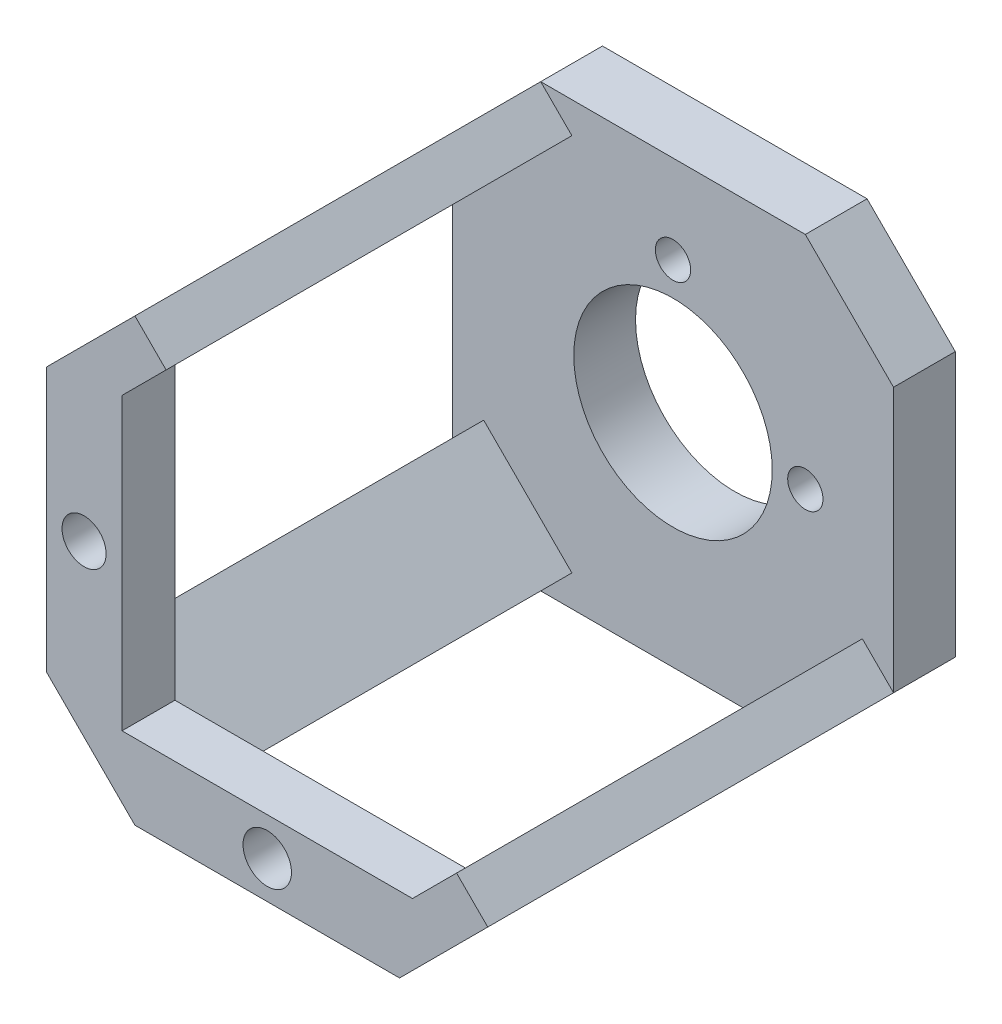
ISO-10303-21;
HEADER;
FILE_DESCRIPTION(('STEP AP214'),'2;1');
FILE_NAME('part.step','',(''),(''),'','','');
FILE_SCHEMA(('AUTOMOTIVE_DESIGN { 1 0 10303 214 1 1 1 1 }'));
ENDSEC;
DATA;
#1=APPLICATION_CONTEXT('core data for automotive mechanical design processes');
#2=APPLICATION_PROTOCOL_DEFINITION('international standard','automotive_design',2000,#1);
#3=PRODUCT_CONTEXT('',#1,'mechanical');
#4=PRODUCT('Part','Part','',(#3));
#5=PRODUCT_RELATED_PRODUCT_CATEGORY('part','',(#4));
#6=PRODUCT_DEFINITION_FORMATION('','',#4);
#7=PRODUCT_DEFINITION_CONTEXT('part definition',#1,'design');
#8=PRODUCT_DEFINITION('design','',#6,#7);
#9=PRODUCT_DEFINITION_SHAPE('','',#8);
#10=(LENGTH_UNIT() NAMED_UNIT(*) SI_UNIT(.MILLI.,.METRE.));
#11=(NAMED_UNIT(*) PLANE_ANGLE_UNIT() SI_UNIT($,.RADIAN.));
#12=(NAMED_UNIT(*) SI_UNIT($,.STERADIAN.) SOLID_ANGLE_UNIT());
#13=UNCERTAINTY_MEASURE_WITH_UNIT(LENGTH_MEASURE(1.E-05),#10,'distance_accuracy_value','');
#14=(GEOMETRIC_REPRESENTATION_CONTEXT(3) GLOBAL_UNCERTAINTY_ASSIGNED_CONTEXT((#13)) GLOBAL_UNIT_ASSIGNED_CONTEXT((#10,
#11,#12)) REPRESENTATION_CONTEXT('',''));
#15=CARTESIAN_POINT('',(0.,0.,0.));
#16=DIRECTION('',(0.,0.,1.));
#17=DIRECTION('',(1.,0.,0.));
#18=AXIS2_PLACEMENT_3D('',#15,#16,#17);
#19=CARTESIAN_POINT('',(0.,0.,7.));
#20=DIRECTION('',(0.,0.,1.));
#21=DIRECTION('',(1.,0.,0.));
#22=AXIS2_PLACEMENT_3D('',#19,#20,#21);
#23=PLANE('',#22);
#24=CARTESIAN_POINT('',(13.1164289128277,-2.01271186440679,7.));
#25=DIRECTION('',(0.,0.,1.));
#26=DIRECTION('',(1.,0.,0.));
#27=AXIS2_PLACEMENT_3D('',#24,#25,#26);
#28=CIRCLE('',#27,2.);
#29=CARTESIAN_POINT('',(15.1164289128277,-2.01271186440679,7.));
#30=VERTEX_POINT('',#29);
#31=EDGE_CURVE('E784',#30,#30,#28,.F.);
#32=ORIENTED_EDGE('',*,*,#31,.T.);
#33=EDGE_LOOP('',(#32));
#34=FACE_BOUND('',#33,.T.);
#35=CARTESIAN_POINT('',(-1.88357108717233,12.9872881355932,7.));
#36=DIRECTION('',(0.,0.,1.));
#37=DIRECTION('',(1.,0.,0.));
#38=AXIS2_PLACEMENT_3D('',#35,#36,#37);
#39=CIRCLE('',#38,2.);
#40=CARTESIAN_POINT('',(0.116428912827668,12.9872881355932,7.));
#41=VERTEX_POINT('',#40);
#42=EDGE_CURVE('E791',#41,#41,#39,.F.);
#43=ORIENTED_EDGE('',*,*,#42,.T.);
#44=EDGE_LOOP('',(#43));
#45=FACE_BOUND('',#44,.T.);
#46=CARTESIAN_POINT('',(-1.88357108717233,-2.01271186440679,7.));
#47=DIRECTION('',(0.,0.,1.));
#48=DIRECTION('',(1.,0.,0.));
#49=AXIS2_PLACEMENT_3D('',#46,#47,#48);
#50=CIRCLE('',#49,11.25);
#51=CARTESIAN_POINT('',(9.36642891282767,-2.01271186440679,7.));
#52=VERTEX_POINT('',#51);
#53=EDGE_CURVE('E225',#52,#52,#50,.F.);
#54=ORIENTED_EDGE('',*,*,#53,.T.);
#55=EDGE_LOOP('',(#54));
#56=FACE_BOUND('',#55,.T.);
#57=DIRECTION('',(-0.707106781186546,0.707106781186549,0.));
#58=VECTOR('',#57,1.);
#59=CARTESIAN_POINT('',(-13.3480371812396,-23.4771779584741,7.));
#60=LINE('',#59,#58);
#61=CARTESIAN_POINT('',(-13.3480371812396,-23.4771779584741,7.));
#62=VERTEX_POINT('',#61);
#63=CARTESIAN_POINT('',(-23.3480371812396,-13.477177958474,7.));
#64=VERTEX_POINT('',#63);
#65=EDGE_CURVE('E311',#62,#64,#60,.T.);
#66=ORIENTED_EDGE('',*,*,#65,.F.);
#67=DIRECTION('',(0.707106781186549,0.707106781186546,0.));
#68=VECTOR('',#67,1.);
#69=CARTESIAN_POINT('',(-16.8835710871723,-27.0127118644068,7.));
#70=LINE('',#69,#68);
#71=CARTESIAN_POINT('',(-16.8835710871723,-27.0127118644068,7.));
#72=VERTEX_POINT('',#71);
#73=EDGE_CURVE('E314',#72,#62,#70,.T.);
#74=ORIENTED_EDGE('',*,*,#73,.F.);
#75=DIRECTION('',(1.,0.,0.));
#76=VECTOR('',#75,1.);
#77=CARTESIAN_POINT('',(-26.8835710871723,-27.0127118644068,7.));
#78=LINE('',#77,#76);
#79=CARTESIAN_POINT('',(13.1164289128276,-27.0127118644068,7.));
#80=VERTEX_POINT('',#79);
#81=EDGE_CURVE('E366',#72,#80,#78,.T.);
#82=ORIENTED_EDGE('',*,*,#81,.T.);
#83=DIRECTION('',(0.707106781186555,-0.70710678118654,0.));
#84=VECTOR('',#83,1.);
#85=CARTESIAN_POINT('',(-6.94814147578972,-6.94814147578986,7.));
#86=LINE('',#85,#84);
#87=CARTESIAN_POINT('',(9.58089500689481,-23.4771779584741,7.));
#88=VERTEX_POINT('',#87);
#89=EDGE_CURVE('E337',#88,#80,#86,.T.);
#90=ORIENTED_EDGE('',*,*,#89,.F.);
#91=DIRECTION('',(-0.707106781186549,-0.707106781186546,0.));
#92=VECTOR('',#91,1.);
#93=CARTESIAN_POINT('',(16.5290364826844,-16.5290364826845,7.));
#94=LINE('',#93,#92);
#95=CARTESIAN_POINT('',(19.5808950068949,-13.477177958474,7.));
#96=VERTEX_POINT('',#95);
#97=EDGE_CURVE('E340',#96,#88,#94,.T.);
#98=ORIENTED_EDGE('',*,*,#97,.F.);
#99=DIRECTION('',(-0.707106781186551,0.707106781186544,0.));
#100=VECTOR('',#99,1.);
#101=CARTESIAN_POINT('',(3.05185852421033,3.05185852421036,7.));
#102=LINE('',#101,#100);
#103=CARTESIAN_POINT('',(23.1164289128277,-17.0127118644068,7.));
#104=VERTEX_POINT('',#103);
#105=EDGE_CURVE('E334',#104,#96,#102,.T.);
#106=ORIENTED_EDGE('',*,*,#105,.F.);
#107=DIRECTION('',(0.,-1.,0.));
#108=VECTOR('',#107,1.);
#109=CARTESIAN_POINT('',(23.1164289128277,22.9872881355932,7.));
#110=LINE('',#109,#108);
#111=CARTESIAN_POINT('',(23.1164289128277,12.9872881355932,7.));
#112=VERTEX_POINT('',#111);
#113=EDGE_CURVE('E370',#112,#104,#110,.T.);
#114=ORIENTED_EDGE('',*,*,#113,.F.);
#115=DIRECTION('',(0.707106781186546,-0.707106781186549,0.));
#116=VECTOR('',#115,1.);
#117=CARTESIAN_POINT('',(18.0518585242105,18.0518585242104,7.));
#118=LINE('',#117,#116);
#119=CARTESIAN_POINT('',(13.1164289128277,22.9872881355932,7.));
#120=VERTEX_POINT('',#119);
#121=EDGE_CURVE('E405',#112,#120,#118,.F.);
#122=ORIENTED_EDGE('',*,*,#121,.T.);
#123=DIRECTION('',(1.,0.,0.));
#124=VECTOR('',#123,1.);
#125=CARTESIAN_POINT('',(-26.8835710871723,22.9872881355932,7.));
#126=LINE('',#125,#124);
#127=CARTESIAN_POINT('',(-16.8835710871723,22.9872881355932,7.));
#128=VERTEX_POINT('',#127);
#129=EDGE_CURVE('E373',#128,#120,#126,.T.);
#130=ORIENTED_EDGE('',*,*,#129,.F.);
#131=DIRECTION('',(0.707106781186546,-0.707106781186549,0.));
#132=VECTOR('',#131,1.);
#133=CARTESIAN_POINT('',(3.05185852421043,3.05185852421042,7.));
#134=LINE('',#133,#132);
#135=CARTESIAN_POINT('',(-13.3480371812396,19.4517542296605,7.));
#136=VERTEX_POINT('',#135);
#137=EDGE_CURVE('E348',#128,#136,#134,.T.);
#138=ORIENTED_EDGE('',*,*,#137,.T.);
#139=DIRECTION('',(-0.707106781186548,-0.707106781186547,0.));
#140=VECTOR('',#139,1.);
#141=CARTESIAN_POINT('',(-16.39989570545,16.39989570545,7.));
#142=LINE('',#141,#140);
#143=CARTESIAN_POINT('',(-23.3480371812396,9.45175422966046,7.));
#144=VERTEX_POINT('',#143);
#145=EDGE_CURVE('E351',#136,#144,#142,.T.);
#146=ORIENTED_EDGE('',*,*,#145,.T.);
#147=DIRECTION('',(-0.707106781186547,0.707106781186548,0.));
#148=VECTOR('',#147,1.);
#149=CARTESIAN_POINT('',(-6.9481414757896,-6.94814147578958,7.));
#150=LINE('',#149,#148);
#151=CARTESIAN_POINT('',(-26.8835710871723,12.9872881355932,7.));
#152=VERTEX_POINT('',#151);
#153=EDGE_CURVE('E343',#144,#152,#150,.T.);
#154=ORIENTED_EDGE('',*,*,#153,.T.);
#155=DIRECTION('',(0.,-1.,0.));
#156=VECTOR('',#155,1.);
#157=CARTESIAN_POINT('',(-26.8835710871723,22.9872881355932,7.));
#158=LINE('',#157,#156);
#159=CARTESIAN_POINT('',(-26.8835710871723,-17.0127118644067,7.));
#160=VERTEX_POINT('',#159);
#161=EDGE_CURVE('E363',#152,#160,#158,.T.);
#162=ORIENTED_EDGE('',*,*,#161,.T.);
#163=DIRECTION('',(-0.707106781186549,-0.707106781186546,0.));
#164=VECTOR('',#163,1.);
#165=CARTESIAN_POINT('',(-23.3480371812396,-13.477177958474,7.));
#166=LINE('',#165,#164);
#167=EDGE_CURVE('E308',#64,#160,#166,.T.);
#168=ORIENTED_EDGE('',*,*,#167,.F.);
#169=EDGE_LOOP('',(#66,#74,#82,#90,#98,#106,#114,#122,#130,#138,#146,#154,#162,#168));
#170=FACE_BOUND('',#169,.T.);
#171=ADVANCED_FACE('F33',(#34,#45,#56,#170),#23,.T.);
#172=CARTESIAN_POINT('',(-26.8835710871723,22.9872881355932,7.));
#173=DIRECTION('',(1.,0.,0.));
#174=DIRECTION('',(0.,1.,0.));
#175=AXIS2_PLACEMENT_3D('',#172,#173,#174);
#176=PLANE('',#175);
#177=ORIENTED_EDGE('',*,*,#161,.F.);
#178=DIRECTION('',(0.,0.,-1.));
#179=VECTOR('',#178,1.);
#180=CARTESIAN_POINT('',(-26.8835710871723,12.9872881355932,0.));
#181=LINE('',#180,#179);
#182=CARTESIAN_POINT('',(-26.8835710871723,12.9872881355932,0.));
#183=VERTEX_POINT('',#182);
#184=EDGE_CURVE('E388',#152,#183,#181,.T.);
#185=ORIENTED_EDGE('',*,*,#184,.T.);
#186=DIRECTION('',(0.,-1.,0.));
#187=VECTOR('',#186,1.);
#188=CARTESIAN_POINT('',(-26.8835710871723,22.9872881355932,0.));
#189=LINE('',#188,#187);
#190=CARTESIAN_POINT('',(-26.8835710871723,-17.0127118644068,0.));
#191=VERTEX_POINT('',#190);
#192=EDGE_CURVE('E362',#183,#191,#189,.T.);
#193=ORIENTED_EDGE('',*,*,#192,.T.);
#194=DIRECTION('',(0.,0.,1.));
#195=VECTOR('',#194,1.);
#196=CARTESIAN_POINT('',(-26.8835710871723,-17.0127118644068,7.));
#197=LINE('',#196,#195);
#198=EDGE_CURVE('E376',#191,#160,#197,.T.);
#199=ORIENTED_EDGE('',*,*,#198,.T.);
#200=EDGE_LOOP('',(#177,#185,#193,#199));
#201=FACE_BOUND('',#200,.T.);
#202=ADVANCED_FACE('F457',(#201),#176,.F.);
#203=CARTESIAN_POINT('',(-26.8835710871723,-27.0127118644068,7.));
#204=DIRECTION('',(0.,1.,0.));
#205=DIRECTION('',(0.,0.,1.));
#206=AXIS2_PLACEMENT_3D('',#203,#204,#205);
#207=PLANE('',#206);
#208=ORIENTED_EDGE('',*,*,#81,.F.);
#209=DIRECTION('',(0.,0.,-1.));
#210=VECTOR('',#209,1.);
#211=CARTESIAN_POINT('',(-16.8835710871723,-27.0127118644068,7.));
#212=LINE('',#211,#210);
#213=CARTESIAN_POINT('',(-16.8835710871723,-27.0127118644068,0.));
#214=VERTEX_POINT('',#213);
#215=EDGE_CURVE('E11',#72,#214,#212,.T.);
#216=ORIENTED_EDGE('',*,*,#215,.T.);
#217=DIRECTION('',(1.,0.,0.));
#218=VECTOR('',#217,1.);
#219=CARTESIAN_POINT('',(-26.8835710871723,-27.0127118644068,0.));
#220=LINE('',#219,#218);
#221=CARTESIAN_POINT('',(13.1164289128276,-27.0127118644068,0.));
#222=VERTEX_POINT('',#221);
#223=EDGE_CURVE('E379',#214,#222,#220,.T.);
#224=ORIENTED_EDGE('',*,*,#223,.T.);
#225=DIRECTION('',(0.,0.,1.));
#226=VECTOR('',#225,1.);
#227=CARTESIAN_POINT('',(13.1164289128276,-27.0127118644068,7.));
#228=LINE('',#227,#226);
#229=EDGE_CURVE('E42',#222,#80,#228,.T.);
#230=ORIENTED_EDGE('',*,*,#229,.T.);
#231=EDGE_LOOP('',(#208,#216,#224,#230));
#232=FACE_BOUND('',#231,.T.);
#233=ADVANCED_FACE('F414',(#232),#207,.F.);
#234=CARTESIAN_POINT('',(23.1164289128277,22.9872881355932,7.));
#235=DIRECTION('',(1.,0.,0.));
#236=DIRECTION('',(0.,1.,0.));
#237=AXIS2_PLACEMENT_3D('',#234,#235,#236);
#238=PLANE('',#237);
#239=DIRECTION('',(0.,-1.,0.));
#240=VECTOR('',#239,1.);
#241=CARTESIAN_POINT('',(23.1164289128277,22.9872881355932,0.));
#242=LINE('',#241,#240);
#243=CARTESIAN_POINT('',(23.1164289128277,12.9872881355932,0.));
#244=VERTEX_POINT('',#243);
#245=CARTESIAN_POINT('',(23.1164289128277,-17.0127118644068,0.));
#246=VERTEX_POINT('',#245);
#247=EDGE_CURVE('E382',#244,#246,#242,.T.);
#248=ORIENTED_EDGE('',*,*,#247,.F.);
#249=DIRECTION('',(0.,0.,1.));
#250=VECTOR('',#249,1.);
#251=CARTESIAN_POINT('',(23.1164289128277,12.9872881355932,7.));
#252=LINE('',#251,#250);
#253=EDGE_CURVE('E410',#244,#112,#252,.T.);
#254=ORIENTED_EDGE('',*,*,#253,.T.);
#255=ORIENTED_EDGE('',*,*,#113,.T.);
#256=DIRECTION('',(0.,0.,-1.));
#257=VECTOR('',#256,1.);
#258=CARTESIAN_POINT('',(23.1164289128277,-17.0127118644068,0.));
#259=LINE('',#258,#257);
#260=EDGE_CURVE('E407',#104,#246,#259,.T.);
#261=ORIENTED_EDGE('',*,*,#260,.T.);
#262=EDGE_LOOP('',(#248,#254,#255,#261));
#263=FACE_BOUND('',#262,.T.);
#264=ADVANCED_FACE('F480',(#263),#238,.T.);
#265=CARTESIAN_POINT('',(-26.8835710871723,22.9872881355932,7.));
#266=DIRECTION('',(0.,1.,0.));
#267=DIRECTION('',(0.,0.,1.));
#268=AXIS2_PLACEMENT_3D('',#265,#266,#267);
#269=PLANE('',#268);
#270=DIRECTION('',(1.,0.,0.));
#271=VECTOR('',#270,1.);
#272=CARTESIAN_POINT('',(-26.8835710871723,22.9872881355932,0.));
#273=LINE('',#272,#271);
#274=CARTESIAN_POINT('',(-16.8835710871723,22.9872881355932,0.));
#275=VERTEX_POINT('',#274);
#276=CARTESIAN_POINT('',(13.1164289128277,22.9872881355932,0.));
#277=VERTEX_POINT('',#276);
#278=EDGE_CURVE('E367',#275,#277,#273,.T.);
#279=ORIENTED_EDGE('',*,*,#278,.F.);
#280=DIRECTION('',(0.,0.,1.));
#281=VECTOR('',#280,1.);
#282=CARTESIAN_POINT('',(-16.8835710871723,22.9872881355932,7.));
#283=LINE('',#282,#281);
#284=EDGE_CURVE('E402',#275,#128,#283,.T.);
#285=ORIENTED_EDGE('',*,*,#284,.T.);
#286=ORIENTED_EDGE('',*,*,#129,.T.);
#287=DIRECTION('',(0.,0.,-1.));
#288=VECTOR('',#287,1.);
#289=CARTESIAN_POINT('',(13.1164289128277,22.9872881355932,7.));
#290=LINE('',#289,#288);
#291=EDGE_CURVE('E399',#120,#277,#290,.T.);
#292=ORIENTED_EDGE('',*,*,#291,.T.);
#293=EDGE_LOOP('',(#279,#285,#286,#292));
#294=FACE_BOUND('',#293,.T.);
#295=ADVANCED_FACE('F476',(#294),#269,.T.);
#296=CARTESIAN_POINT('',(0.,0.,0.));
#297=DIRECTION('',(0.,0.,1.));
#298=DIRECTION('',(1.,0.,0.));
#299=AXIS2_PLACEMENT_3D('',#296,#297,#298);
#300=PLANE('',#299);
#301=CARTESIAN_POINT('',(13.1164289128277,-2.01271186440679,0.));
#302=DIRECTION('',(0.,0.,-1.));
#303=DIRECTION('',(-1.,0.,0.));
#304=AXIS2_PLACEMENT_3D('',#301,#302,#303);
#305=CIRCLE('',#304,2.);
#306=CARTESIAN_POINT('',(11.1164289128277,-2.01271186440679,0.));
#307=VERTEX_POINT('',#306);
#308=EDGE_CURVE('E782',#307,#307,#305,.T.);
#309=ORIENTED_EDGE('',*,*,#308,.F.);
#310=EDGE_LOOP('',(#309));
#311=FACE_BOUND('',#310,.T.);
#312=CARTESIAN_POINT('',(-1.88357108717233,12.9872881355932,0.));
#313=DIRECTION('',(0.,0.,-1.));
#314=DIRECTION('',(-1.,0.,0.));
#315=AXIS2_PLACEMENT_3D('',#312,#313,#314);
#316=CIRCLE('',#315,2.);
#317=CARTESIAN_POINT('',(-3.88357108717233,12.9872881355932,0.));
#318=VERTEX_POINT('',#317);
#319=EDGE_CURVE('E786',#318,#318,#316,.T.);
#320=ORIENTED_EDGE('',*,*,#319,.F.);
#321=EDGE_LOOP('',(#320));
#322=FACE_BOUND('',#321,.T.);
#323=CARTESIAN_POINT('',(-1.88357108717233,-2.01271186440679,0.));
#324=DIRECTION('',(0.,0.,-1.));
#325=DIRECTION('',(-1.,0.,0.));
#326=AXIS2_PLACEMENT_3D('',#323,#324,#325);
#327=CIRCLE('',#326,11.25);
#328=CARTESIAN_POINT('',(-13.1335710871723,-2.01271186440679,0.));
#329=VERTEX_POINT('',#328);
#330=EDGE_CURVE('E230',#329,#329,#327,.T.);
#331=ORIENTED_EDGE('',*,*,#330,.F.);
#332=EDGE_LOOP('',(#331));
#333=FACE_BOUND('',#332,.T.);
#334=ORIENTED_EDGE('',*,*,#192,.F.);
#335=DIRECTION('',(0.707106781186549,0.707106781186546,0.));
#336=VECTOR('',#335,1.);
#337=CARTESIAN_POINT('',(-26.8835710871723,12.9872881355932,0.));
#338=LINE('',#337,#336);
#339=EDGE_CURVE('E397',#183,#275,#338,.T.);
#340=ORIENTED_EDGE('',*,*,#339,.T.);
#341=ORIENTED_EDGE('',*,*,#278,.T.);
#342=DIRECTION('',(-0.707106781186546,0.707106781186549,0.));
#343=VECTOR('',#342,1.);
#344=CARTESIAN_POINT('',(13.1164289128277,22.9872881355932,0.));
#345=LINE('',#344,#343);
#346=EDGE_CURVE('E395',#277,#244,#345,.F.);
#347=ORIENTED_EDGE('',*,*,#346,.T.);
#348=ORIENTED_EDGE('',*,*,#247,.T.);
#349=DIRECTION('',(-0.707106781186549,-0.707106781186546,0.));
#350=VECTOR('',#349,1.);
#351=CARTESIAN_POINT('',(23.1164289128277,-17.0127118644068,0.));
#352=LINE('',#351,#350);
#353=EDGE_CURVE('E391',#246,#222,#352,.T.);
#354=ORIENTED_EDGE('',*,*,#353,.T.);
#355=ORIENTED_EDGE('',*,*,#223,.F.);
#356=DIRECTION('',(0.707106781186546,-0.707106781186549,0.));
#357=VECTOR('',#356,1.);
#358=CARTESIAN_POINT('',(-16.8835710871723,-27.0127118644068,0.));
#359=LINE('',#358,#357);
#360=EDGE_CURVE('E393',#214,#191,#359,.F.);
#361=ORIENTED_EDGE('',*,*,#360,.T.);
#362=EDGE_LOOP('',(#334,#340,#341,#347,#348,#354,#355,#361));
#363=FACE_BOUND('',#362,.T.);
#364=ADVANCED_FACE('F473',(#311,#322,#333,#363),#300,.F.);
#365=CARTESIAN_POINT('',(-26.8835710871723,12.9872881355932,7.));
#366=DIRECTION('',(-0.707106781186546,0.707106781186549,0.));
#367=DIRECTION('',(0.,0.,1.));
#368=AXIS2_PLACEMENT_3D('',#365,#366,#367);
#369=PLANE('',#368);
#370=ORIENTED_EDGE('',*,*,#184,.F.);
#371=DIRECTION('',(0.,0.,-1.));
#372=VECTOR('',#371,1.);
#373=CARTESIAN_POINT('',(-26.8835710871723,12.9872881355932,47.));
#374=LINE('',#373,#372);
#375=CARTESIAN_POINT('',(-26.8835710871723,12.9872881355932,47.));
#376=VERTEX_POINT('',#375);
#377=EDGE_CURVE('E347',#376,#152,#374,.T.);
#378=ORIENTED_EDGE('',*,*,#377,.F.);
#379=DIRECTION('',(0.,0.,-1.));
#380=VECTOR('',#379,1.);
#381=CARTESIAN_POINT('',(-26.8835710871723,12.9872881355932,53.));
#382=LINE('',#381,#380);
#383=CARTESIAN_POINT('',(-26.8835710871723,12.9872881355932,53.));
#384=VERTEX_POINT('',#383);
#385=EDGE_CURVE('E213',#384,#376,#382,.T.);
#386=ORIENTED_EDGE('',*,*,#385,.F.);
#387=DIRECTION('',(-0.707106781186549,-0.707106781186546,0.));
#388=VECTOR('',#387,1.);
#389=CARTESIAN_POINT('',(-16.8835710871723,22.9872881355932,53.));
#390=LINE('',#389,#388);
#391=CARTESIAN_POINT('',(-16.8835710871723,22.9872881355932,53.));
#392=VERTEX_POINT('',#391);
#393=EDGE_CURVE('E240',#392,#384,#390,.T.);
#394=ORIENTED_EDGE('',*,*,#393,.F.);
#395=DIRECTION('',(0.,0.,-1.));
#396=VECTOR('',#395,1.);
#397=CARTESIAN_POINT('',(-16.8835710871723,22.9872881355932,47.));
#398=LINE('',#397,#396);
#399=EDGE_CURVE('E357',#392,#128,#398,.T.);
#400=ORIENTED_EDGE('',*,*,#399,.T.);
#401=ORIENTED_EDGE('',*,*,#284,.F.);
#402=ORIENTED_EDGE('',*,*,#339,.F.);
#403=EDGE_LOOP('',(#370,#378,#386,#394,#400,#401,#402));
#404=FACE_BOUND('',#403,.T.);
#405=ADVANCED_FACE('F475',(#404),#369,.T.);
#406=CARTESIAN_POINT('',(13.1164289128277,22.9872881355932,7.));
#407=DIRECTION('',(-0.707106781186549,-0.707106781186546,0.));
#408=DIRECTION('',(0.,0.,-1.));
#409=AXIS2_PLACEMENT_3D('',#406,#407,#408);
#410=PLANE('',#409);
#411=ORIENTED_EDGE('',*,*,#121,.F.);
#412=ORIENTED_EDGE('',*,*,#253,.F.);
#413=ORIENTED_EDGE('',*,*,#346,.F.);
#414=ORIENTED_EDGE('',*,*,#291,.F.);
#415=EDGE_LOOP('',(#411,#412,#413,#414));
#416=FACE_BOUND('',#415,.T.);
#417=ADVANCED_FACE('F489',(#416),#410,.F.);
#418=CARTESIAN_POINT('',(-16.8835710871723,-27.0127118644068,7.));
#419=DIRECTION('',(0.707106781186549,0.707106781186546,0.));
#420=DIRECTION('',(0.,0.,-1.));
#421=AXIS2_PLACEMENT_3D('',#418,#419,#420);
#422=PLANE('',#421);
#423=ORIENTED_EDGE('',*,*,#215,.F.);
#424=DIRECTION('',(0.,0.,-1.));
#425=VECTOR('',#424,1.);
#426=CARTESIAN_POINT('',(-16.8835710871723,-27.0127118644068,47.));
#427=LINE('',#426,#425);
#428=CARTESIAN_POINT('',(-16.8835710871723,-27.0127118644068,47.));
#429=VERTEX_POINT('',#428);
#430=EDGE_CURVE('E304',#429,#72,#427,.T.);
#431=ORIENTED_EDGE('',*,*,#430,.F.);
#432=DIRECTION('',(0.,0.,-1.));
#433=VECTOR('',#432,1.);
#434=CARTESIAN_POINT('',(-16.8835710871723,-27.0127118644068,53.));
#435=LINE('',#434,#433);
#436=CARTESIAN_POINT('',(-16.8835710871723,-27.0127118644068,53.));
#437=VERTEX_POINT('',#436);
#438=EDGE_CURVE('E265',#437,#429,#435,.T.);
#439=ORIENTED_EDGE('',*,*,#438,.F.);
#440=DIRECTION('',(0.707106781186546,-0.707106781186549,0.));
#441=VECTOR('',#440,1.);
#442=CARTESIAN_POINT('',(-26.8835710871723,-17.0127118644067,53.));
#443=LINE('',#442,#441);
#444=CARTESIAN_POINT('',(-26.8835710871723,-17.0127118644067,53.));
#445=VERTEX_POINT('',#444);
#446=EDGE_CURVE('E244',#445,#437,#443,.T.);
#447=ORIENTED_EDGE('',*,*,#446,.F.);
#448=DIRECTION('',(0.,0.,-1.));
#449=VECTOR('',#448,1.);
#450=CARTESIAN_POINT('',(-26.8835710871723,-17.0127118644067,53.));
#451=LINE('',#450,#449);
#452=CARTESIAN_POINT('',(-26.8835710871723,-17.0127118644067,47.));
#453=VERTEX_POINT('',#452);
#454=EDGE_CURVE('E217',#445,#453,#451,.T.);
#455=ORIENTED_EDGE('',*,*,#454,.T.);
#456=DIRECTION('',(0.,0.,-1.));
#457=VECTOR('',#456,1.);
#458=CARTESIAN_POINT('',(-26.8835710871723,-17.0127118644067,47.));
#459=LINE('',#458,#457);
#460=EDGE_CURVE('E299',#453,#160,#459,.T.);
#461=ORIENTED_EDGE('',*,*,#460,.T.);
#462=ORIENTED_EDGE('',*,*,#198,.F.);
#463=ORIENTED_EDGE('',*,*,#360,.F.);
#464=EDGE_LOOP('',(#423,#431,#439,#447,#455,#461,#462,#463));
#465=FACE_BOUND('',#464,.T.);
#466=ADVANCED_FACE('F441',(#465),#422,.F.);
#467=CARTESIAN_POINT('',(23.1164289128277,-17.0127118644068,7.));
#468=DIRECTION('',(0.707106781186546,-0.707106781186549,0.));
#469=DIRECTION('',(0.,0.,1.));
#470=AXIS2_PLACEMENT_3D('',#467,#468,#469);
#471=PLANE('',#470);
#472=ORIENTED_EDGE('',*,*,#260,.F.);
#473=DIRECTION('',(0.,0.,-1.));
#474=VECTOR('',#473,1.);
#475=CARTESIAN_POINT('',(23.1164289128277,-17.0127118644068,47.));
#476=LINE('',#475,#474);
#477=CARTESIAN_POINT('',(23.1164289128277,-17.0127118644068,53.));
#478=VERTEX_POINT('',#477);
#479=EDGE_CURVE('E327',#478,#104,#476,.T.);
#480=ORIENTED_EDGE('',*,*,#479,.F.);
#481=DIRECTION('',(0.707106781186548,0.707106781186547,0.));
#482=VECTOR('',#481,1.);
#483=CARTESIAN_POINT('',(13.1164289128276,-27.0127118644068,53.));
#484=LINE('',#483,#482);
#485=CARTESIAN_POINT('',(13.1164289128276,-27.0127118644068,53.));
#486=VERTEX_POINT('',#485);
#487=EDGE_CURVE('E248',#486,#478,#484,.T.);
#488=ORIENTED_EDGE('',*,*,#487,.F.);
#489=DIRECTION('',(0.,0.,-1.));
#490=VECTOR('',#489,1.);
#491=CARTESIAN_POINT('',(13.1164289128276,-27.0127118644068,53.));
#492=LINE('',#491,#490);
#493=CARTESIAN_POINT('',(13.1164289128276,-27.0127118644068,47.));
#494=VERTEX_POINT('',#493);
#495=EDGE_CURVE('E262',#486,#494,#492,.T.);
#496=ORIENTED_EDGE('',*,*,#495,.T.);
#497=DIRECTION('',(0.,0.,-1.));
#498=VECTOR('',#497,1.);
#499=CARTESIAN_POINT('',(13.1164289128276,-27.0127118644068,47.));
#500=LINE('',#499,#498);
#501=EDGE_CURVE('E324',#494,#80,#500,.T.);
#502=ORIENTED_EDGE('',*,*,#501,.T.);
#503=ORIENTED_EDGE('',*,*,#229,.F.);
#504=ORIENTED_EDGE('',*,*,#353,.F.);
#505=EDGE_LOOP('',(#472,#480,#488,#496,#502,#503,#504));
#506=FACE_BOUND('',#505,.T.);
#507=ADVANCED_FACE('F35',(#506),#471,.T.);
#508=CARTESIAN_POINT('',(-6.9481414757896,-6.94814147578958,47.));
#509=DIRECTION('',(-0.707106781186548,-0.707106781186547,0.));
#510=DIRECTION('',(0.707106781186547,-0.707106781186548,0.));
#511=AXIS2_PLACEMENT_3D('',#508,#509,#510);
#512=PLANE('',#511);
#513=ORIENTED_EDGE('',*,*,#153,.F.);
#514=DIRECTION('',(0.,0.,-1.));
#515=VECTOR('',#514,1.);
#516=CARTESIAN_POINT('',(-23.3480371812396,9.45175422966046,47.));
#517=LINE('',#516,#515);
#518=CARTESIAN_POINT('',(-23.3480371812396,9.45175422966046,47.));
#519=VERTEX_POINT('',#518);
#520=EDGE_CURVE('E360',#519,#144,#517,.T.);
#521=ORIENTED_EDGE('',*,*,#520,.F.);
#522=DIRECTION('',(-0.707106781186547,0.707106781186548,0.));
#523=VECTOR('',#522,1.);
#524=CARTESIAN_POINT('',(-6.9481414757896,-6.94814147578958,47.));
#525=LINE('',#524,#523);
#526=EDGE_CURVE('E289',#519,#376,#525,.T.);
#527=ORIENTED_EDGE('',*,*,#526,.T.);
#528=ORIENTED_EDGE('',*,*,#377,.T.);
#529=EDGE_LOOP('',(#513,#521,#527,#528));
#530=FACE_BOUND('',#529,.T.);
#531=ADVANCED_FACE('F471',(#530),#512,.T.);
#532=CARTESIAN_POINT('',(-16.39989570545,16.39989570545,47.));
#533=DIRECTION('',(0.707106781186547,-0.707106781186548,0.));
#534=DIRECTION('',(0.707106781186548,0.707106781186547,0.));
#535=AXIS2_PLACEMENT_3D('',#532,#533,#534);
#536=PLANE('',#535);
#537=ORIENTED_EDGE('',*,*,#145,.F.);
#538=DIRECTION('',(0.,0.,-1.));
#539=VECTOR('',#538,1.);
#540=CARTESIAN_POINT('',(-13.3480371812396,19.4517542296605,47.));
#541=LINE('',#540,#539);
#542=CARTESIAN_POINT('',(-13.3480371812396,19.4517542296605,53.));
#543=VERTEX_POINT('',#542);
#544=EDGE_CURVE('E194',#543,#136,#541,.T.);
#545=ORIENTED_EDGE('',*,*,#544,.F.);
#546=DIRECTION('',(0.707106781186548,0.707106781186547,0.));
#547=VECTOR('',#546,1.);
#548=CARTESIAN_POINT('',(-18.3480371812396,14.4517542296605,53.));
#549=LINE('',#548,#547);
#550=CARTESIAN_POINT('',(-18.3480371812396,14.4517542296605,53.));
#551=VERTEX_POINT('',#550);
#552=EDGE_CURVE('E186',#551,#543,#549,.T.);
#553=ORIENTED_EDGE('',*,*,#552,.F.);
#554=DIRECTION('',(0.,0.,-1.));
#555=VECTOR('',#554,1.);
#556=CARTESIAN_POINT('',(-18.3480371812396,14.4517542296605,53.));
#557=LINE('',#556,#555);
#558=CARTESIAN_POINT('',(-18.3480371812396,14.4517542296605,47.));
#559=VERTEX_POINT('',#558);
#560=EDGE_CURVE('E192',#551,#559,#557,.T.);
#561=ORIENTED_EDGE('',*,*,#560,.T.);
#562=DIRECTION('',(-0.707106781186548,-0.707106781186547,0.));
#563=VECTOR('',#562,1.);
#564=CARTESIAN_POINT('',(-16.39989570545,16.39989570545,47.));
#565=LINE('',#564,#563);
#566=EDGE_CURVE('E215',#559,#519,#565,.T.);
#567=ORIENTED_EDGE('',*,*,#566,.T.);
#568=ORIENTED_EDGE('',*,*,#520,.T.);
#569=EDGE_LOOP('',(#537,#545,#553,#561,#567,#568));
#570=FACE_BOUND('',#569,.T.);
#571=ADVANCED_FACE('F189',(#570),#536,.T.);
#572=CARTESIAN_POINT('',(3.05185852421043,3.05185852421042,47.));
#573=DIRECTION('',(0.707106781186549,0.707106781186546,0.));
#574=DIRECTION('',(-0.707106781186546,0.707106781186549,0.));
#575=AXIS2_PLACEMENT_3D('',#572,#573,#574);
#576=PLANE('',#575);
#577=ORIENTED_EDGE('',*,*,#137,.F.);
#578=ORIENTED_EDGE('',*,*,#399,.F.);
#579=DIRECTION('',(-0.707106781186547,0.707106781186548,0.));
#580=VECTOR('',#579,1.);
#581=CARTESIAN_POINT('',(-13.3480371812396,19.4517542296605,53.));
#582=LINE('',#581,#580);
#583=EDGE_CURVE('E198',#543,#392,#582,.T.);
#584=ORIENTED_EDGE('',*,*,#583,.F.);
#585=ORIENTED_EDGE('',*,*,#544,.T.);
#586=EDGE_LOOP('',(#577,#578,#584,#585));
#587=FACE_BOUND('',#586,.T.);
#588=ADVANCED_FACE('F505',(#587),#576,.T.);
#589=CARTESIAN_POINT('',(16.5290364826844,-16.5290364826845,47.));
#590=DIRECTION('',(0.707106781186546,-0.707106781186549,0.));
#591=DIRECTION('',(0.707106781186549,0.707106781186546,0.));
#592=AXIS2_PLACEMENT_3D('',#589,#590,#591);
#593=PLANE('',#592);
#594=ORIENTED_EDGE('',*,*,#97,.T.);
#595=DIRECTION('',(0.,0.,-1.));
#596=VECTOR('',#595,1.);
#597=CARTESIAN_POINT('',(9.58089500689481,-23.4771779584741,47.));
#598=LINE('',#597,#596);
#599=CARTESIAN_POINT('',(9.58089500689481,-23.4771779584741,47.));
#600=VERTEX_POINT('',#599);
#601=EDGE_CURVE('E316',#600,#88,#598,.T.);
#602=ORIENTED_EDGE('',*,*,#601,.F.);
#603=DIRECTION('',(-0.707106781186549,-0.707106781186546,0.));
#604=VECTOR('',#603,1.);
#605=CARTESIAN_POINT('',(16.5290364826844,-16.5290364826845,47.));
#606=LINE('',#605,#604);
#607=CARTESIAN_POINT('',(14.5808950068949,-18.477177958474,47.));
#608=VERTEX_POINT('',#607);
#609=EDGE_CURVE('E50',#608,#600,#606,.T.);
#610=ORIENTED_EDGE('',*,*,#609,.F.);
#611=DIRECTION('',(0.,0.,-1.));
#612=VECTOR('',#611,1.);
#613=CARTESIAN_POINT('',(14.5808950068949,-18.477177958474,53.));
#614=LINE('',#613,#612);
#615=CARTESIAN_POINT('',(14.5808950068949,-18.477177958474,53.));
#616=VERTEX_POINT('',#615);
#617=EDGE_CURVE('E261',#616,#608,#614,.T.);
#618=ORIENTED_EDGE('',*,*,#617,.F.);
#619=DIRECTION('',(-0.707106781186549,-0.707106781186546,0.));
#620=VECTOR('',#619,1.);
#621=CARTESIAN_POINT('',(19.5808950068949,-13.477177958474,53.));
#622=LINE('',#621,#620);
#623=CARTESIAN_POINT('',(19.5808950068949,-13.477177958474,53.));
#624=VERTEX_POINT('',#623);
#625=EDGE_CURVE('E254',#624,#616,#622,.T.);
#626=ORIENTED_EDGE('',*,*,#625,.F.);
#627=DIRECTION('',(0.,0.,-1.));
#628=VECTOR('',#627,1.);
#629=CARTESIAN_POINT('',(19.5808950068949,-13.477177958474,47.));
#630=LINE('',#629,#628);
#631=EDGE_CURVE('E330',#624,#96,#630,.T.);
#632=ORIENTED_EDGE('',*,*,#631,.T.);
#633=EDGE_LOOP('',(#594,#602,#610,#618,#626,#632));
#634=FACE_BOUND('',#633,.T.);
#635=ADVANCED_FACE('F430',(#634),#593,.F.);
#636=CARTESIAN_POINT('',(-6.94814147578972,-6.94814147578986,47.));
#637=DIRECTION('',(0.70710678118654,0.707106781186555,0.));
#638=DIRECTION('',(-0.707106781186555,0.70710678118654,0.));
#639=AXIS2_PLACEMENT_3D('',#636,#637,#638);
#640=PLANE('',#639);
#641=ORIENTED_EDGE('',*,*,#89,.T.);
#642=ORIENTED_EDGE('',*,*,#501,.F.);
#643=DIRECTION('',(0.707106781186555,-0.70710678118654,0.));
#644=VECTOR('',#643,1.);
#645=CARTESIAN_POINT('',(-6.94814147578972,-6.94814147578986,47.));
#646=LINE('',#645,#644);
#647=EDGE_CURVE('E333',#600,#494,#646,.T.);
#648=ORIENTED_EDGE('',*,*,#647,.F.);
#649=ORIENTED_EDGE('',*,*,#601,.T.);
#650=EDGE_LOOP('',(#641,#642,#648,#649));
#651=FACE_BOUND('',#650,.T.);
#652=ADVANCED_FACE('F420',(#651),#640,.F.);
#653=CARTESIAN_POINT('',(3.05185852421033,3.05185852421036,47.));
#654=DIRECTION('',(-0.707106781186544,-0.707106781186551,0.));
#655=DIRECTION('',(0.707106781186551,-0.707106781186544,0.));
#656=AXIS2_PLACEMENT_3D('',#653,#654,#655);
#657=PLANE('',#656);
#658=ORIENTED_EDGE('',*,*,#105,.T.);
#659=ORIENTED_EDGE('',*,*,#631,.F.);
#660=DIRECTION('',(-0.70710678118655,0.707106781186545,0.));
#661=VECTOR('',#660,1.);
#662=CARTESIAN_POINT('',(23.1164289128277,-17.0127118644068,53.));
#663=LINE('',#662,#661);
#664=EDGE_CURVE('E251',#478,#624,#663,.T.);
#665=ORIENTED_EDGE('',*,*,#664,.F.);
#666=ORIENTED_EDGE('',*,*,#479,.T.);
#667=EDGE_LOOP('',(#658,#659,#665,#666));
#668=FACE_BOUND('',#667,.T.);
#669=ADVANCED_FACE('F435',(#668),#657,.F.);
#670=CARTESIAN_POINT('',(-16.8835710871723,-27.0127118644068,47.));
#671=DIRECTION('',(-0.707106781186546,0.707106781186549,0.));
#672=DIRECTION('',(-0.707106781186549,-0.707106781186546,0.));
#673=AXIS2_PLACEMENT_3D('',#670,#671,#672);
#674=PLANE('',#673);
#675=ORIENTED_EDGE('',*,*,#73,.T.);
#676=DIRECTION('',(0.,0.,-1.));
#677=VECTOR('',#676,1.);
#678=CARTESIAN_POINT('',(-13.3480371812396,-23.4771779584741,47.));
#679=LINE('',#678,#677);
#680=CARTESIAN_POINT('',(-13.3480371812396,-23.4771779584741,47.));
#681=VERTEX_POINT('',#680);
#682=EDGE_CURVE('E292',#681,#62,#679,.T.);
#683=ORIENTED_EDGE('',*,*,#682,.F.);
#684=DIRECTION('',(0.707106781186549,0.707106781186546,0.));
#685=VECTOR('',#684,1.);
#686=CARTESIAN_POINT('',(-16.8835710871723,-27.0127118644068,47.));
#687=LINE('',#686,#685);
#688=EDGE_CURVE('E312',#429,#681,#687,.T.);
#689=ORIENTED_EDGE('',*,*,#688,.F.);
#690=ORIENTED_EDGE('',*,*,#430,.T.);
#691=EDGE_LOOP('',(#675,#683,#689,#690));
#692=FACE_BOUND('',#691,.T.);
#693=ADVANCED_FACE('F443',(#692),#674,.F.);
#694=CARTESIAN_POINT('',(-13.3480371812396,-23.4771779584741,47.));
#695=DIRECTION('',(-0.707106781186549,-0.707106781186546,0.));
#696=DIRECTION('',(0.707106781186546,-0.707106781186549,0.));
#697=AXIS2_PLACEMENT_3D('',#694,#695,#696);
#698=PLANE('',#697);
#699=ORIENTED_EDGE('',*,*,#65,.T.);
#700=DIRECTION('',(0.,0.,-1.));
#701=VECTOR('',#700,1.);
#702=CARTESIAN_POINT('',(-23.3480371812396,-13.477177958474,47.));
#703=LINE('',#702,#701);
#704=CARTESIAN_POINT('',(-23.3480371812396,-13.477177958474,47.));
#705=VERTEX_POINT('',#704);
#706=EDGE_CURVE('E294',#705,#64,#703,.T.);
#707=ORIENTED_EDGE('',*,*,#706,.F.);
#708=DIRECTION('',(-0.707106781186546,0.707106781186549,0.));
#709=VECTOR('',#708,1.);
#710=CARTESIAN_POINT('',(-13.3480371812396,-23.4771779584741,47.));
#711=LINE('',#710,#709);
#712=CARTESIAN_POINT('',(-18.3480371812396,-18.477177958474,47.));
#713=VERTEX_POINT('',#712);
#714=EDGE_CURVE('E58',#713,#705,#711,.T.);
#715=ORIENTED_EDGE('',*,*,#714,.F.);
#716=EDGE_CURVE('E318',#681,#713,#711,.T.);
#717=ORIENTED_EDGE('',*,*,#716,.F.);
#718=ORIENTED_EDGE('',*,*,#682,.T.);
#719=EDGE_LOOP('',(#699,#707,#715,#717,#718));
#720=FACE_BOUND('',#719,.T.);
#721=ADVANCED_FACE('F445',(#720),#698,.F.);
#722=CARTESIAN_POINT('',(-23.3480371812396,-13.477177958474,47.));
#723=DIRECTION('',(0.707106781186546,-0.707106781186549,0.));
#724=DIRECTION('',(0.707106781186549,0.707106781186546,0.));
#725=AXIS2_PLACEMENT_3D('',#722,#723,#724);
#726=PLANE('',#725);
#727=ORIENTED_EDGE('',*,*,#167,.T.);
#728=ORIENTED_EDGE('',*,*,#460,.F.);
#729=DIRECTION('',(-0.707106781186549,-0.707106781186546,0.));
#730=VECTOR('',#729,1.);
#731=CARTESIAN_POINT('',(-23.3480371812396,-13.477177958474,47.));
#732=LINE('',#731,#730);
#733=EDGE_CURVE('E307',#705,#453,#732,.T.);
#734=ORIENTED_EDGE('',*,*,#733,.F.);
#735=ORIENTED_EDGE('',*,*,#706,.T.);
#736=EDGE_LOOP('',(#727,#728,#734,#735));
#737=FACE_BOUND('',#736,.T.);
#738=ADVANCED_FACE('F451',(#737),#726,.F.);
#739=CARTESIAN_POINT('',(0.,0.,47.));
#740=DIRECTION('',(0.,0.,-1.));
#741=DIRECTION('',(-1.,0.,0.));
#742=AXIS2_PLACEMENT_3D('',#739,#740,#741);
#743=PLANE('',#742);
#744=CARTESIAN_POINT('',(-22.6480371812396,-2.01271186440679,47.));
#745=DIRECTION('',(0.,0.,-1.));
#746=DIRECTION('',(-1.,0.,0.));
#747=AXIS2_PLACEMENT_3D('',#744,#745,#746);
#748=CIRCLE('',#747,2.5);
#749=CARTESIAN_POINT('',(-25.1480371812396,-2.01271186440679,47.));
#750=VERTEX_POINT('',#749);
#751=EDGE_CURVE('E235',#750,#750,#748,.F.);
#752=ORIENTED_EDGE('',*,*,#751,.T.);
#753=EDGE_LOOP('',(#752));
#754=FACE_BOUND('',#753,.T.);
#755=ORIENTED_EDGE('',*,*,#526,.F.);
#756=ORIENTED_EDGE('',*,*,#566,.F.);
#757=DIRECTION('',(0.,1.,0.));
#758=VECTOR('',#757,1.);
#759=CARTESIAN_POINT('',(-18.3480371812396,-18.477177958474,47.));
#760=LINE('',#759,#758);
#761=EDGE_CURVE('E212',#713,#559,#760,.T.);
#762=ORIENTED_EDGE('',*,*,#761,.F.);
#763=ORIENTED_EDGE('',*,*,#714,.T.);
#764=ORIENTED_EDGE('',*,*,#733,.T.);
#765=DIRECTION('',(0.,-1.,0.));
#766=VECTOR('',#765,1.);
#767=CARTESIAN_POINT('',(-26.8835710871723,12.9872881355932,47.));
#768=LINE('',#767,#766);
#769=EDGE_CURVE('E224',#376,#453,#768,.T.);
#770=ORIENTED_EDGE('',*,*,#769,.F.);
#771=EDGE_LOOP('',(#755,#756,#762,#763,#764,#770));
#772=FACE_BOUND('',#771,.T.);
#773=ADVANCED_FACE('F285',(#754,#772),#743,.T.);
#774=CARTESIAN_POINT('',(-1.88357108717233,-22.777177958474,47.));
#775=DIRECTION('',(0.,0.,-1.));
#776=DIRECTION('',(-1.,0.,0.));
#777=AXIS2_PLACEMENT_3D('',#774,#775,#776);
#778=CIRCLE('',#777,2.74500766384704);
#779=CARTESIAN_POINT('',(-4.62857875101938,-22.777177958474,47.));
#780=VERTEX_POINT('',#779);
#781=EDGE_CURVE('E797',#780,#780,#778,.F.);
#782=ORIENTED_EDGE('',*,*,#781,.T.);
#783=EDGE_LOOP('',(#782));
#784=FACE_BOUND('',#783,.T.);
#785=DIRECTION('',(-1.,0.,0.));
#786=VECTOR('',#785,1.);
#787=CARTESIAN_POINT('',(14.5808950068949,-18.477177958474,47.));
#788=LINE('',#787,#786);
#789=EDGE_CURVE('E208',#608,#713,#788,.T.);
#790=ORIENTED_EDGE('',*,*,#789,.F.);
#791=ORIENTED_EDGE('',*,*,#609,.T.);
#792=ORIENTED_EDGE('',*,*,#647,.T.);
#793=DIRECTION('',(1.,0.,0.));
#794=VECTOR('',#793,1.);
#795=CARTESIAN_POINT('',(-16.8835710871723,-27.0127118644068,47.));
#796=LINE('',#795,#794);
#797=EDGE_CURVE('E227',#429,#494,#796,.T.);
#798=ORIENTED_EDGE('',*,*,#797,.F.);
#799=ORIENTED_EDGE('',*,*,#688,.T.);
#800=ORIENTED_EDGE('',*,*,#716,.T.);
#801=EDGE_LOOP('',(#790,#791,#792,#798,#799,#800));
#802=FACE_BOUND('',#801,.T.);
#803=ADVANCED_FACE('F428',(#784,#802),#743,.T.);
#804=CARTESIAN_POINT('',(-18.3480371812396,-18.477177958474,53.));
#805=DIRECTION('',(-1.,0.,0.));
#806=DIRECTION('',(0.,-1.,0.));
#807=AXIS2_PLACEMENT_3D('',#804,#805,#806);
#808=PLANE('',#807);
#809=ORIENTED_EDGE('',*,*,#761,.T.);
#810=ORIENTED_EDGE('',*,*,#560,.F.);
#811=DIRECTION('',(0.,1.,0.));
#812=VECTOR('',#811,1.);
#813=CARTESIAN_POINT('',(-18.3480371812396,-18.477177958474,53.));
#814=LINE('',#813,#812);
#815=CARTESIAN_POINT('',(-18.3480371812396,-18.477177958474,53.));
#816=VERTEX_POINT('',#815);
#817=EDGE_CURVE('E199',#816,#551,#814,.T.);
#818=ORIENTED_EDGE('',*,*,#817,.F.);
#819=DIRECTION('',(0.,0.,-1.));
#820=VECTOR('',#819,1.);
#821=CARTESIAN_POINT('',(-18.3480371812396,-18.477177958474,53.));
#822=LINE('',#821,#820);
#823=EDGE_CURVE('E256',#816,#713,#822,.T.);
#824=ORIENTED_EDGE('',*,*,#823,.T.);
#825=EDGE_LOOP('',(#809,#810,#818,#824));
#826=FACE_BOUND('',#825,.T.);
#827=ADVANCED_FACE('F210',(#826),#808,.F.);
#828=CARTESIAN_POINT('',(-26.8835710871723,12.9872881355932,53.));
#829=DIRECTION('',(1.,0.,0.));
#830=DIRECTION('',(0.,1.,0.));
#831=AXIS2_PLACEMENT_3D('',#828,#829,#830);
#832=PLANE('',#831);
#833=ORIENTED_EDGE('',*,*,#769,.T.);
#834=ORIENTED_EDGE('',*,*,#454,.F.);
#835=DIRECTION('',(0.,-1.,0.));
#836=VECTOR('',#835,1.);
#837=CARTESIAN_POINT('',(-26.8835710871723,12.9872881355932,53.));
#838=LINE('',#837,#836);
#839=EDGE_CURVE('E242',#384,#445,#838,.T.);
#840=ORIENTED_EDGE('',*,*,#839,.F.);
#841=ORIENTED_EDGE('',*,*,#385,.T.);
#842=EDGE_LOOP('',(#833,#834,#840,#841));
#843=FACE_BOUND('',#842,.T.);
#844=ADVANCED_FACE('F518',(#843),#832,.F.);
#845=CARTESIAN_POINT('',(-16.8835710871723,-27.0127118644068,53.));
#846=DIRECTION('',(0.,1.,0.));
#847=DIRECTION('',(-1.,0.,0.));
#848=AXIS2_PLACEMENT_3D('',#845,#846,#847);
#849=PLANE('',#848);
#850=ORIENTED_EDGE('',*,*,#797,.T.);
#851=ORIENTED_EDGE('',*,*,#495,.F.);
#852=DIRECTION('',(1.,0.,0.));
#853=VECTOR('',#852,1.);
#854=CARTESIAN_POINT('',(-16.8835710871723,-27.0127118644068,53.));
#855=LINE('',#854,#853);
#856=EDGE_CURVE('E246',#437,#486,#855,.T.);
#857=ORIENTED_EDGE('',*,*,#856,.F.);
#858=ORIENTED_EDGE('',*,*,#438,.T.);
#859=EDGE_LOOP('',(#850,#851,#857,#858));
#860=FACE_BOUND('',#859,.T.);
#861=ADVANCED_FACE('F425',(#860),#849,.F.);
#862=CARTESIAN_POINT('',(14.5808950068949,-18.477177958474,53.));
#863=DIRECTION('',(0.,-1.,0.));
#864=DIRECTION('',(1.,0.,0.));
#865=AXIS2_PLACEMENT_3D('',#862,#863,#864);
#866=PLANE('',#865);
#867=ORIENTED_EDGE('',*,*,#789,.T.);
#868=ORIENTED_EDGE('',*,*,#823,.F.);
#869=DIRECTION('',(-1.,0.,0.));
#870=VECTOR('',#869,1.);
#871=CARTESIAN_POINT('',(14.5808950068949,-18.477177958474,53.));
#872=LINE('',#871,#870);
#873=EDGE_CURVE('E204',#616,#816,#872,.T.);
#874=ORIENTED_EDGE('',*,*,#873,.F.);
#875=ORIENTED_EDGE('',*,*,#617,.T.);
#876=EDGE_LOOP('',(#867,#868,#874,#875));
#877=FACE_BOUND('',#876,.T.);
#878=ADVANCED_FACE('F282',(#877),#866,.F.);
#879=CARTESIAN_POINT('',(0.,0.,53.));
#880=DIRECTION('',(0.,0.,-1.));
#881=DIRECTION('',(-1.,0.,0.));
#882=AXIS2_PLACEMENT_3D('',#879,#880,#881);
#883=PLANE('',#882);
#884=CARTESIAN_POINT('',(-1.88357108717233,-22.777177958474,53.));
#885=DIRECTION('',(0.,0.,1.));
#886=DIRECTION('',(1.,0.,0.));
#887=AXIS2_PLACEMENT_3D('',#884,#885,#886);
#888=CIRCLE('',#887,2.74500766384704);
#889=CARTESIAN_POINT('',(0.861436576674712,-22.777177958474,53.));
#890=VERTEX_POINT('',#889);
#891=EDGE_CURVE('E794',#890,#890,#888,.T.);
#892=ORIENTED_EDGE('',*,*,#891,.F.);
#893=EDGE_LOOP('',(#892));
#894=FACE_BOUND('',#893,.T.);
#895=CARTESIAN_POINT('',(-22.6480371812396,-2.01271186440679,53.));
#896=DIRECTION('',(0.,0.,1.));
#897=DIRECTION('',(1.,0.,0.));
#898=AXIS2_PLACEMENT_3D('',#895,#896,#897);
#899=CIRCLE('',#898,2.5);
#900=CARTESIAN_POINT('',(-20.1480371812396,-2.01271186440679,53.));
#901=VERTEX_POINT('',#900);
#902=EDGE_CURVE('E800',#901,#901,#899,.T.);
#903=ORIENTED_EDGE('',*,*,#902,.F.);
#904=EDGE_LOOP('',(#903));
#905=FACE_BOUND('',#904,.T.);
#906=ORIENTED_EDGE('',*,*,#817,.T.);
#907=ORIENTED_EDGE('',*,*,#552,.T.);
#908=ORIENTED_EDGE('',*,*,#583,.T.);
#909=ORIENTED_EDGE('',*,*,#393,.T.);
#910=ORIENTED_EDGE('',*,*,#839,.T.);
#911=ORIENTED_EDGE('',*,*,#446,.T.);
#912=ORIENTED_EDGE('',*,*,#856,.T.);
#913=ORIENTED_EDGE('',*,*,#487,.T.);
#914=ORIENTED_EDGE('',*,*,#664,.T.);
#915=ORIENTED_EDGE('',*,*,#625,.T.);
#916=ORIENTED_EDGE('',*,*,#873,.T.);
#917=EDGE_LOOP('',(#906,#907,#908,#909,#910,#911,#912,#913,#914,#915,#916));
#918=FACE_BOUND('',#917,.T.);
#919=ADVANCED_FACE('F202',(#894,#905,#918),#883,.F.);
#920=CARTESIAN_POINT('',(-1.88357108717233,-2.01271186440679,38.8198051533946));
#921=DIRECTION('',(0.,0.,-1.));
#922=DIRECTION('',(-1.,0.,0.));
#923=AXIS2_PLACEMENT_3D('',#920,#921,#922);
#924=CYLINDRICAL_SURFACE('',#923,11.25);
#925=ORIENTED_EDGE('',*,*,#330,.T.);
#926=EDGE_LOOP('',(#925));
#927=FACE_BOUND('',#926,.T.);
#928=ORIENTED_EDGE('',*,*,#53,.F.);
#929=EDGE_LOOP('',(#928));
#930=FACE_BOUND('',#929,.T.);
#931=ADVANCED_FACE('F590',(#927,#930),#924,.F.);
#932=CARTESIAN_POINT('',(-22.6480371812396,-2.01271186440679,39.2359458659389));
#933=DIRECTION('',(0.,0.,1.));
#934=DIRECTION('',(1.,0.,0.));
#935=AXIS2_PLACEMENT_3D('',#932,#933,#934);
#936=CYLINDRICAL_SURFACE('',#935,2.5);
#937=ORIENTED_EDGE('',*,*,#902,.T.);
#938=EDGE_LOOP('',(#937));
#939=FACE_BOUND('',#938,.T.);
#940=ORIENTED_EDGE('',*,*,#751,.F.);
#941=EDGE_LOOP('',(#940));
#942=FACE_BOUND('',#941,.T.);
#943=ADVANCED_FACE('F598',(#939,#942),#936,.F.);
#944=CARTESIAN_POINT('',(-1.88357108717233,-22.777177958474,39.2359458659389));
#945=DIRECTION('',(0.,0.,1.));
#946=DIRECTION('',(1.,0.,0.));
#947=AXIS2_PLACEMENT_3D('',#944,#945,#946);
#948=CYLINDRICAL_SURFACE('',#947,2.74500766384704);
#949=ORIENTED_EDGE('',*,*,#891,.T.);
#950=EDGE_LOOP('',(#949));
#951=FACE_BOUND('',#950,.T.);
#952=ORIENTED_EDGE('',*,*,#781,.F.);
#953=EDGE_LOOP('',(#952));
#954=FACE_BOUND('',#953,.T.);
#955=ADVANCED_FACE('F605',(#951,#954),#948,.F.);
#956=CARTESIAN_POINT('',(-1.88357108717233,12.9872881355932,12.6568542494924));
#957=DIRECTION('',(0.,0.,-1.));
#958=DIRECTION('',(-1.,0.,0.));
#959=AXIS2_PLACEMENT_3D('',#956,#957,#958);
#960=CYLINDRICAL_SURFACE('',#959,2.);
#961=ORIENTED_EDGE('',*,*,#319,.T.);
#962=EDGE_LOOP('',(#961));
#963=FACE_BOUND('',#962,.T.);
#964=ORIENTED_EDGE('',*,*,#42,.F.);
#965=EDGE_LOOP('',(#964));
#966=FACE_BOUND('',#965,.T.);
#967=ADVANCED_FACE('F612',(#963,#966),#960,.F.);
#968=CARTESIAN_POINT('',(13.1164289128277,-2.01271186440679,12.6568542494924));
#969=DIRECTION('',(0.,0.,-1.));
#970=DIRECTION('',(-1.,0.,0.));
#971=AXIS2_PLACEMENT_3D('',#968,#969,#970);
#972=CYLINDRICAL_SURFACE('',#971,2.);
#973=ORIENTED_EDGE('',*,*,#308,.T.);
#974=EDGE_LOOP('',(#973));
#975=FACE_BOUND('',#974,.T.);
#976=ORIENTED_EDGE('',*,*,#31,.F.);
#977=EDGE_LOOP('',(#976));
#978=FACE_BOUND('',#977,.T.);
#979=ADVANCED_FACE('F620',(#975,#978),#972,.F.);
#980=CLOSED_SHELL('',(#171,#202,#233,#264,#295,#364,#405,#417,#466,#507,#531,#571,#588,#635,
#652,#669,#693,#721,#738,#773,#803,#827,#844,#861,#878,#919,#931,#943,#955,#967,#979));
#981=MANIFOLD_SOLID_BREP('B2',#980);
#982=ADVANCED_BREP_SHAPE_REPRESENTATION('',(#18,#981),#14);
#983=SHAPE_DEFINITION_REPRESENTATION(#9,#982);
ENDSEC;
END-ISO-10303-21;
